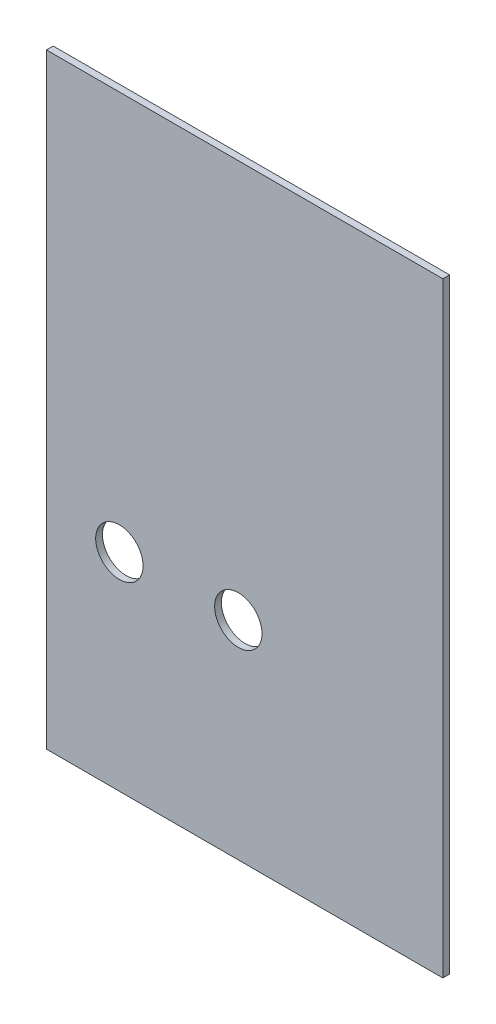
ISO-10303-21;
HEADER;
FILE_DESCRIPTION(('STEP AP214'),'2;1');
FILE_NAME('part.step','',(''),(''),'','','');
FILE_SCHEMA(('AUTOMOTIVE_DESIGN { 1 0 10303 214 1 1 1 1 }'));
ENDSEC;
DATA;
#1=APPLICATION_CONTEXT('core data for automotive mechanical design processes');
#2=APPLICATION_PROTOCOL_DEFINITION('international standard','automotive_design',2000,#1);
#3=PRODUCT_CONTEXT('',#1,'mechanical');
#4=PRODUCT('Part','Part','',(#3));
#5=PRODUCT_RELATED_PRODUCT_CATEGORY('part','',(#4));
#6=PRODUCT_DEFINITION_FORMATION('','',#4);
#7=PRODUCT_DEFINITION_CONTEXT('part definition',#1,'design');
#8=PRODUCT_DEFINITION('design','',#6,#7);
#9=PRODUCT_DEFINITION_SHAPE('','',#8);
#10=(LENGTH_UNIT() NAMED_UNIT(*) SI_UNIT(.MILLI.,.METRE.));
#11=(NAMED_UNIT(*) PLANE_ANGLE_UNIT() SI_UNIT($,.RADIAN.));
#12=(NAMED_UNIT(*) SI_UNIT($,.STERADIAN.) SOLID_ANGLE_UNIT());
#13=UNCERTAINTY_MEASURE_WITH_UNIT(LENGTH_MEASURE(1.E-05),#10,'distance_accuracy_value','');
#14=(GEOMETRIC_REPRESENTATION_CONTEXT(3) GLOBAL_UNCERTAINTY_ASSIGNED_CONTEXT((#13)) GLOBAL_UNIT_ASSIGNED_CONTEXT((#10,
#11,#12)) REPRESENTATION_CONTEXT('',''));
#15=CARTESIAN_POINT('',(0.,0.,0.));
#16=DIRECTION('',(0.,0.,1.));
#17=DIRECTION('',(1.,0.,0.));
#18=AXIS2_PLACEMENT_3D('',#15,#16,#17);
#19=CARTESIAN_POINT('',(0.,285.110155160905,1.5875));
#20=DIRECTION('',(1.,0.,0.));
#21=DIRECTION('',(0.,1.,0.));
#22=AXIS2_PLACEMENT_3D('',#19,#20,#21);
#23=PLANE('',#22);
#24=DIRECTION('',(0.,-1.,0.));
#25=VECTOR('',#24,1.);
#26=CARTESIAN_POINT('',(0.,285.110155160905,-1.5875));
#27=LINE('',#26,#25);
#28=CARTESIAN_POINT('',(0.,285.110155160905,-1.5875));
#29=VERTEX_POINT('',#28);
#30=CARTESIAN_POINT('',(0.,0.,-1.5875));
#31=VERTEX_POINT('',#30);
#32=EDGE_CURVE('E100',#29,#31,#27,.T.);
#33=ORIENTED_EDGE('',*,*,#32,.T.);
#34=DIRECTION('',(0.,0.,-1.));
#35=VECTOR('',#34,1.);
#36=CARTESIAN_POINT('',(0.,0.,1.5875));
#37=LINE('',#36,#35);
#38=CARTESIAN_POINT('',(0.,0.,1.5875));
#39=VERTEX_POINT('',#38);
#40=EDGE_CURVE('E11',#39,#31,#37,.T.);
#41=ORIENTED_EDGE('',*,*,#40,.F.);
#42=DIRECTION('',(0.,-1.,0.));
#43=VECTOR('',#42,1.);
#44=CARTESIAN_POINT('',(0.,285.110155160905,1.5875));
#45=LINE('',#44,#43);
#46=CARTESIAN_POINT('',(0.,285.110155160905,1.5875));
#47=VERTEX_POINT('',#46);
#48=EDGE_CURVE('E86',#47,#39,#45,.T.);
#49=ORIENTED_EDGE('',*,*,#48,.F.);
#50=DIRECTION('',(0.,0.,-1.));
#51=VECTOR('',#50,1.);
#52=CARTESIAN_POINT('',(0.,285.110155160905,1.5875));
#53=LINE('',#52,#51);
#54=EDGE_CURVE('E53',#47,#29,#53,.T.);
#55=ORIENTED_EDGE('',*,*,#54,.T.);
#56=EDGE_LOOP('',(#33,#41,#49,#55));
#57=FACE_BOUND('',#56,.T.);
#58=ADVANCED_FACE('F37',(#57),#23,.F.);
#59=CARTESIAN_POINT('',(0.,0.,1.5875));
#60=DIRECTION('',(0.,1.,0.));
#61=DIRECTION('',(-1.,0.,0.));
#62=AXIS2_PLACEMENT_3D('',#59,#60,#61);
#63=PLANE('',#62);
#64=DIRECTION('',(1.,0.,0.));
#65=VECTOR('',#64,1.);
#66=CARTESIAN_POINT('',(0.,0.,-1.5875));
#67=LINE('',#66,#65);
#68=CARTESIAN_POINT('',(186.616953842174,0.,-1.5875));
#69=VERTEX_POINT('',#68);
#70=EDGE_CURVE('E91',#31,#69,#67,.T.);
#71=ORIENTED_EDGE('',*,*,#70,.T.);
#72=DIRECTION('',(0.,0.,-1.));
#73=VECTOR('',#72,1.);
#74=CARTESIAN_POINT('',(186.616953842174,0.,1.5875));
#75=LINE('',#74,#73);
#76=CARTESIAN_POINT('',(186.616953842174,0.,1.5875));
#77=VERTEX_POINT('',#76);
#78=EDGE_CURVE('E45',#77,#69,#75,.T.);
#79=ORIENTED_EDGE('',*,*,#78,.F.);
#80=DIRECTION('',(1.,0.,0.));
#81=VECTOR('',#80,1.);
#82=CARTESIAN_POINT('',(0.,0.,1.5875));
#83=LINE('',#82,#81);
#84=EDGE_CURVE('E79',#39,#77,#83,.T.);
#85=ORIENTED_EDGE('',*,*,#84,.F.);
#86=ORIENTED_EDGE('',*,*,#40,.T.);
#87=EDGE_LOOP('',(#71,#79,#85,#86));
#88=FACE_BOUND('',#87,.T.);
#89=ADVANCED_FACE('F90',(#88),#63,.F.);
#90=CARTESIAN_POINT('',(186.616953842174,0.,1.5875));
#91=DIRECTION('',(-1.,0.,0.));
#92=DIRECTION('',(0.,0.,1.));
#93=AXIS2_PLACEMENT_3D('',#90,#91,#92);
#94=PLANE('',#93);
#95=DIRECTION('',(0.,1.,0.));
#96=VECTOR('',#95,1.);
#97=CARTESIAN_POINT('',(186.616953842174,0.,-1.5875));
#98=LINE('',#97,#96);
#99=CARTESIAN_POINT('',(186.616953842174,285.110155160905,-1.5875));
#100=VERTEX_POINT('',#99);
#101=EDGE_CURVE('E104',#69,#100,#98,.T.);
#102=ORIENTED_EDGE('',*,*,#101,.T.);
#103=DIRECTION('',(0.,0.,-1.));
#104=VECTOR('',#103,1.);
#105=CARTESIAN_POINT('',(186.616953842174,285.110155160905,1.5875));
#106=LINE('',#105,#104);
#107=CARTESIAN_POINT('',(186.616953842174,285.110155160905,1.5875));
#108=VERTEX_POINT('',#107);
#109=EDGE_CURVE('E68',#108,#100,#106,.T.);
#110=ORIENTED_EDGE('',*,*,#109,.F.);
#111=DIRECTION('',(0.,1.,0.));
#112=VECTOR('',#111,1.);
#113=CARTESIAN_POINT('',(186.616953842174,0.,1.5875));
#114=LINE('',#113,#112);
#115=EDGE_CURVE('E85',#77,#108,#114,.T.);
#116=ORIENTED_EDGE('',*,*,#115,.F.);
#117=ORIENTED_EDGE('',*,*,#78,.T.);
#118=EDGE_LOOP('',(#102,#110,#116,#117));
#119=FACE_BOUND('',#118,.T.);
#120=ADVANCED_FACE('F94',(#119),#94,.F.);
#121=CARTESIAN_POINT('',(0.,285.110155160905,1.5875));
#122=DIRECTION('',(0.,1.,0.));
#123=DIRECTION('',(0.,0.,1.));
#124=AXIS2_PLACEMENT_3D('',#121,#122,#123);
#125=PLANE('',#124);
#126=DIRECTION('',(1.,0.,0.));
#127=VECTOR('',#126,1.);
#128=CARTESIAN_POINT('',(0.,285.110155160905,-1.5875));
#129=LINE('',#128,#127);
#130=EDGE_CURVE('E106',#29,#100,#129,.T.);
#131=ORIENTED_EDGE('',*,*,#130,.F.);
#132=ORIENTED_EDGE('',*,*,#54,.F.);
#133=DIRECTION('',(1.,0.,0.));
#134=VECTOR('',#133,1.);
#135=CARTESIAN_POINT('',(0.,285.110155160905,1.5875));
#136=LINE('',#135,#134);
#137=EDGE_CURVE('E95',#47,#108,#136,.T.);
#138=ORIENTED_EDGE('',*,*,#137,.T.);
#139=ORIENTED_EDGE('',*,*,#109,.T.);
#140=EDGE_LOOP('',(#131,#132,#138,#139));
#141=FACE_BOUND('',#140,.T.);
#142=ADVANCED_FACE('F136',(#141),#125,.T.);
#143=CARTESIAN_POINT('',(0.,0.,1.5875));
#144=DIRECTION('',(0.,0.,1.));
#145=DIRECTION('',(1.,0.,0.));
#146=AXIS2_PLACEMENT_3D('',#143,#144,#145);
#147=PLANE('',#146);
#148=CARTESIAN_POINT('',(90.3390125803927,97.8174009805937,1.5875));
#149=DIRECTION('',(0.,0.,1.));
#150=DIRECTION('',(1.,0.,0.));
#151=AXIS2_PLACEMENT_3D('',#148,#149,#150);
#152=CIRCLE('',#151,11.15);
#153=CARTESIAN_POINT('',(101.489012580393,97.8174009805937,1.5875));
#154=VERTEX_POINT('',#153);
#155=EDGE_CURVE('E118',#154,#154,#152,.T.);
#156=ORIENTED_EDGE('',*,*,#155,.F.);
#157=EDGE_LOOP('',(#156));
#158=FACE_BOUND('',#157,.T.);
#159=CARTESIAN_POINT('',(34.3399462588641,97.4940264030109,1.5875));
#160=DIRECTION('',(0.,0.,1.));
#161=DIRECTION('',(1.,0.,0.));
#162=AXIS2_PLACEMENT_3D('',#159,#160,#161);
#163=CIRCLE('',#162,11.15);
#164=CARTESIAN_POINT('',(45.489946258864,97.4940264030109,1.5875));
#165=VERTEX_POINT('',#164);
#166=EDGE_CURVE('E115',#165,#165,#163,.T.);
#167=ORIENTED_EDGE('',*,*,#166,.F.);
#168=EDGE_LOOP('',(#167));
#169=FACE_BOUND('',#168,.T.);
#170=ORIENTED_EDGE('',*,*,#48,.T.);
#171=ORIENTED_EDGE('',*,*,#84,.T.);
#172=ORIENTED_EDGE('',*,*,#115,.T.);
#173=ORIENTED_EDGE('',*,*,#137,.F.);
#174=EDGE_LOOP('',(#170,#171,#172,#173));
#175=FACE_BOUND('',#174,.T.);
#176=ADVANCED_FACE('F82',(#158,#169,#175),#147,.T.);
#177=CARTESIAN_POINT('',(0.,0.,-1.5875));
#178=DIRECTION('',(0.,0.,1.));
#179=DIRECTION('',(1.,0.,0.));
#180=AXIS2_PLACEMENT_3D('',#177,#178,#179);
#181=PLANE('',#180);
#182=CARTESIAN_POINT('',(90.3390125803927,97.8174009805937,-1.5875));
#183=DIRECTION('',(0.,0.,1.));
#184=DIRECTION('',(1.,0.,0.));
#185=AXIS2_PLACEMENT_3D('',#182,#183,#184);
#186=CIRCLE('',#185,11.15);
#187=CARTESIAN_POINT('',(101.489012580393,97.8174009805937,-1.5875));
#188=VERTEX_POINT('',#187);
#189=EDGE_CURVE('E102',#188,#188,#186,.T.);
#190=ORIENTED_EDGE('',*,*,#189,.T.);
#191=EDGE_LOOP('',(#190));
#192=FACE_BOUND('',#191,.T.);
#193=CARTESIAN_POINT('',(34.3399462588641,97.4940264030109,-1.5875));
#194=DIRECTION('',(0.,0.,1.));
#195=DIRECTION('',(1.,0.,0.));
#196=AXIS2_PLACEMENT_3D('',#193,#194,#195);
#197=CIRCLE('',#196,11.15);
#198=CARTESIAN_POINT('',(45.489946258864,97.4940264030109,-1.5875));
#199=VERTEX_POINT('',#198);
#200=EDGE_CURVE('E112',#199,#199,#197,.T.);
#201=ORIENTED_EDGE('',*,*,#200,.T.);
#202=EDGE_LOOP('',(#201));
#203=FACE_BOUND('',#202,.T.);
#204=ORIENTED_EDGE('',*,*,#32,.F.);
#205=ORIENTED_EDGE('',*,*,#130,.T.);
#206=ORIENTED_EDGE('',*,*,#101,.F.);
#207=ORIENTED_EDGE('',*,*,#70,.F.);
#208=EDGE_LOOP('',(#204,#205,#206,#207));
#209=FACE_BOUND('',#208,.T.);
#210=ADVANCED_FACE('F124',(#192,#203,#209),#181,.F.);
#211=CARTESIAN_POINT('',(34.3399462588641,97.4940264030109,-1.5875));
#212=DIRECTION('',(0.,0.,1.));
#213=DIRECTION('',(1.,0.,0.));
#214=AXIS2_PLACEMENT_3D('',#211,#212,#213);
#215=CYLINDRICAL_SURFACE('',#214,11.15);
#216=ORIENTED_EDGE('',*,*,#200,.F.);
#217=EDGE_LOOP('',(#216));
#218=FACE_BOUND('',#217,.T.);
#219=ORIENTED_EDGE('',*,*,#166,.T.);
#220=EDGE_LOOP('',(#219));
#221=FACE_BOUND('',#220,.T.);
#222=ADVANCED_FACE('F130',(#218,#221),#215,.F.);
#223=CARTESIAN_POINT('',(90.3390125803927,97.8174009805937,-1.5875));
#224=DIRECTION('',(0.,0.,1.));
#225=DIRECTION('',(1.,0.,0.));
#226=AXIS2_PLACEMENT_3D('',#223,#224,#225);
#227=CYLINDRICAL_SURFACE('',#226,11.15);
#228=ORIENTED_EDGE('',*,*,#189,.F.);
#229=EDGE_LOOP('',(#228));
#230=FACE_BOUND('',#229,.T.);
#231=ORIENTED_EDGE('',*,*,#155,.T.);
#232=EDGE_LOOP('',(#231));
#233=FACE_BOUND('',#232,.T.);
#234=ADVANCED_FACE('F127',(#230,#233),#227,.F.);
#235=CLOSED_SHELL('',(#58,#89,#120,#142,#176,#210,#222,#234));
#236=MANIFOLD_SOLID_BREP('B2',#235);
#237=ADVANCED_BREP_SHAPE_REPRESENTATION('',(#18,#236),#14);
#238=SHAPE_DEFINITION_REPRESENTATION(#9,#237);
ENDSEC;
END-ISO-10303-21;
